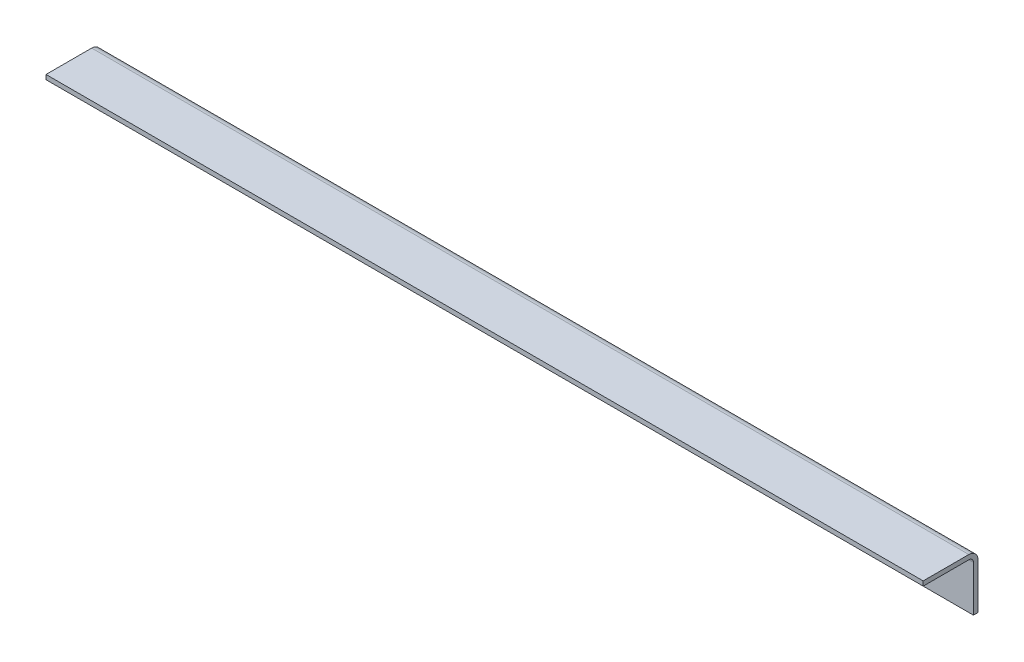
ISO-10303-21;
HEADER;
FILE_DESCRIPTION(('STEP AP214'),'2;1');
FILE_NAME('part.step','',(''),(''),'','','');
FILE_SCHEMA(('AUTOMOTIVE_DESIGN { 1 0 10303 214 1 1 1 1 }'));
ENDSEC;
DATA;
#1=APPLICATION_CONTEXT('core data for automotive mechanical design processes');
#2=APPLICATION_PROTOCOL_DEFINITION('international standard','automotive_design',2000,#1);
#3=PRODUCT_CONTEXT('',#1,'mechanical');
#4=PRODUCT('Part','Part','',(#3));
#5=PRODUCT_RELATED_PRODUCT_CATEGORY('part','',(#4));
#6=PRODUCT_DEFINITION_FORMATION('','',#4);
#7=PRODUCT_DEFINITION_CONTEXT('part definition',#1,'design');
#8=PRODUCT_DEFINITION('design','',#6,#7);
#9=PRODUCT_DEFINITION_SHAPE('','',#8);
#10=(LENGTH_UNIT() NAMED_UNIT(*) SI_UNIT(.MILLI.,.METRE.));
#11=(NAMED_UNIT(*) PLANE_ANGLE_UNIT() SI_UNIT($,.RADIAN.));
#12=(NAMED_UNIT(*) SI_UNIT($,.STERADIAN.) SOLID_ANGLE_UNIT());
#13=UNCERTAINTY_MEASURE_WITH_UNIT(LENGTH_MEASURE(1.E-05),#10,'distance_accuracy_value','');
#14=(GEOMETRIC_REPRESENTATION_CONTEXT(3) GLOBAL_UNCERTAINTY_ASSIGNED_CONTEXT((#13)) GLOBAL_UNIT_ASSIGNED_CONTEXT((#10,
#11,#12)) REPRESENTATION_CONTEXT('',''));
#15=CARTESIAN_POINT('',(0.,0.,0.));
#16=DIRECTION('',(0.,0.,1.));
#17=DIRECTION('',(1.,0.,0.));
#18=AXIS2_PLACEMENT_3D('',#15,#16,#17);
#19=CARTESIAN_POINT('',(609.6,-3.175,38.1));
#20=DIRECTION('',(0.,0.,-1.));
#21=DIRECTION('',(-1.,0.,0.));
#22=AXIS2_PLACEMENT_3D('',#19,#20,#21);
#23=PLANE('',#22);
#24=DIRECTION('',(0.,-1.,0.));
#25=VECTOR('',#24,1.);
#26=CARTESIAN_POINT('',(0.,-3.175,38.1));
#27=LINE('',#26,#25);
#28=CARTESIAN_POINT('',(0.,0.,38.1));
#29=VERTEX_POINT('',#28);
#30=CARTESIAN_POINT('',(0.,-3.175,38.1));
#31=VERTEX_POINT('',#30);
#32=EDGE_CURVE('E123',#29,#31,#27,.T.);
#33=ORIENTED_EDGE('',*,*,#32,.T.);
#34=DIRECTION('',(-1.,0.,0.));
#35=VECTOR('',#34,1.);
#36=CARTESIAN_POINT('',(609.6,-3.175,38.1));
#37=LINE('',#36,#35);
#38=CARTESIAN_POINT('',(609.6,-3.175,38.1));
#39=VERTEX_POINT('',#38);
#40=EDGE_CURVE('E104',#39,#31,#37,.T.);
#41=ORIENTED_EDGE('',*,*,#40,.F.);
#42=DIRECTION('',(0.,-1.,0.));
#43=VECTOR('',#42,1.);
#44=CARTESIAN_POINT('',(609.6,-3.175,38.1));
#45=LINE('',#44,#43);
#46=CARTESIAN_POINT('',(609.6,0.,38.1));
#47=VERTEX_POINT('',#46);
#48=EDGE_CURVE('E111',#47,#39,#45,.T.);
#49=ORIENTED_EDGE('',*,*,#48,.F.);
#50=DIRECTION('',(-1.,0.,0.));
#51=VECTOR('',#50,1.);
#52=CARTESIAN_POINT('',(609.6,0.,38.1));
#53=LINE('',#52,#51);
#54=EDGE_CURVE('E154',#47,#29,#53,.T.);
#55=ORIENTED_EDGE('',*,*,#54,.T.);
#56=EDGE_LOOP('',(#33,#41,#49,#55));
#57=FACE_BOUND('',#56,.T.);
#58=ADVANCED_FACE('F34',(#57),#23,.F.);
#59=CARTESIAN_POINT('',(609.6,-3.175,3.17499999999999));
#60=DIRECTION('',(0.,1.,0.));
#61=DIRECTION('',(0.,0.,1.));
#62=AXIS2_PLACEMENT_3D('',#59,#60,#61);
#63=PLANE('',#62);
#64=DIRECTION('',(0.,0.,-1.));
#65=VECTOR('',#64,1.);
#66=CARTESIAN_POINT('',(0.,-3.175,3.17499999999999));
#67=LINE('',#66,#65);
#68=CARTESIAN_POINT('',(0.,-3.175,6.34999999999999));
#69=VERTEX_POINT('',#68);
#70=EDGE_CURVE('E164',#31,#69,#67,.T.);
#71=ORIENTED_EDGE('',*,*,#70,.T.);
#72=DIRECTION('',(-1.,0.,0.));
#73=VECTOR('',#72,1.);
#74=CARTESIAN_POINT('',(609.6,-3.175,6.34999999999999));
#75=LINE('',#74,#73);
#76=CARTESIAN_POINT('',(609.6,-3.175,6.34999999999999));
#77=VERTEX_POINT('',#76);
#78=EDGE_CURVE('E107',#69,#77,#75,.F.);
#79=ORIENTED_EDGE('',*,*,#78,.T.);
#80=DIRECTION('',(0.,0.,-1.));
#81=VECTOR('',#80,1.);
#82=CARTESIAN_POINT('',(609.6,-3.175,3.17499999999999));
#83=LINE('',#82,#81);
#84=EDGE_CURVE('E99',#39,#77,#83,.T.);
#85=ORIENTED_EDGE('',*,*,#84,.F.);
#86=ORIENTED_EDGE('',*,*,#40,.T.);
#87=EDGE_LOOP('',(#71,#79,#85,#86));
#88=FACE_BOUND('',#87,.T.);
#89=ADVANCED_FACE('F102',(#88),#63,.F.);
#90=CARTESIAN_POINT('',(609.6,-38.1,3.17499999999999));
#91=DIRECTION('',(0.,0.,-1.));
#92=DIRECTION('',(0.,1.,0.));
#93=AXIS2_PLACEMENT_3D('',#90,#91,#92);
#94=PLANE('',#93);
#95=CARTESIAN_POINT('',(50.8,-22.225,3.17499999999999));
#96=DIRECTION('',(0.,0.,1.));
#97=DIRECTION('',(1.,0.,0.));
#98=AXIS2_PLACEMENT_3D('',#95,#96,#97);
#99=CIRCLE('',#98,3.3782);
#100=CARTESIAN_POINT('',(54.1782,-22.225,3.17499999999999));
#101=VERTEX_POINT('',#100);
#102=EDGE_CURVE('E181',#101,#101,#99,.T.);
#103=ORIENTED_EDGE('',*,*,#102,.F.);
#104=EDGE_LOOP('',(#103));
#105=FACE_BOUND('',#104,.T.);
#106=CARTESIAN_POINT('',(558.8,-22.225,3.17499999999999));
#107=DIRECTION('',(0.,0.,1.));
#108=DIRECTION('',(1.,0.,0.));
#109=AXIS2_PLACEMENT_3D('',#106,#107,#108);
#110=CIRCLE('',#109,3.37819999999999);
#111=CARTESIAN_POINT('',(562.1782,-22.225,3.17499999999999));
#112=VERTEX_POINT('',#111);
#113=EDGE_CURVE('E187',#112,#112,#110,.T.);
#114=ORIENTED_EDGE('',*,*,#113,.F.);
#115=EDGE_LOOP('',(#114));
#116=FACE_BOUND('',#115,.T.);
#117=CARTESIAN_POINT('',(304.8,-22.225,3.17499999999999));
#118=DIRECTION('',(0.,0.,1.));
#119=DIRECTION('',(1.,0.,0.));
#120=AXIS2_PLACEMENT_3D('',#117,#118,#119);
#121=CIRCLE('',#120,3.37819999999999);
#122=CARTESIAN_POINT('',(308.1782,-22.225,3.17499999999999));
#123=VERTEX_POINT('',#122);
#124=EDGE_CURVE('E175',#123,#123,#121,.T.);
#125=ORIENTED_EDGE('',*,*,#124,.F.);
#126=EDGE_LOOP('',(#125));
#127=FACE_BOUND('',#126,.T.);
#128=DIRECTION('',(0.,-1.,0.));
#129=VECTOR('',#128,1.);
#130=CARTESIAN_POINT('',(609.6,-38.1,3.17499999999999));
#131=LINE('',#130,#129);
#132=CARTESIAN_POINT('',(609.6,-6.35,3.17499999999999));
#133=VERTEX_POINT('',#132);
#134=CARTESIAN_POINT('',(609.6,-38.1,3.17499999999999));
#135=VERTEX_POINT('',#134);
#136=EDGE_CURVE('E110',#133,#135,#131,.T.);
#137=ORIENTED_EDGE('',*,*,#136,.F.);
#138=DIRECTION('',(-1.,0.,0.));
#139=VECTOR('',#138,1.);
#140=CARTESIAN_POINT('',(0.,-6.35,3.175));
#141=LINE('',#140,#139);
#142=CARTESIAN_POINT('',(0.,-6.35,3.17499999999999));
#143=VERTEX_POINT('',#142);
#144=EDGE_CURVE('E124',#133,#143,#141,.T.);
#145=ORIENTED_EDGE('',*,*,#144,.T.);
#146=DIRECTION('',(0.,-1.,0.));
#147=VECTOR('',#146,1.);
#148=CARTESIAN_POINT('',(0.,-38.1,3.17499999999999));
#149=LINE('',#148,#147);
#150=CARTESIAN_POINT('',(0.,-38.1,3.17499999999999));
#151=VERTEX_POINT('',#150);
#152=EDGE_CURVE('E163',#143,#151,#149,.T.);
#153=ORIENTED_EDGE('',*,*,#152,.T.);
#154=DIRECTION('',(-1.,0.,0.));
#155=VECTOR('',#154,1.);
#156=CARTESIAN_POINT('',(609.6,-38.1,3.17499999999999));
#157=LINE('',#156,#155);
#158=EDGE_CURVE('E125',#135,#151,#157,.T.);
#159=ORIENTED_EDGE('',*,*,#158,.F.);
#160=EDGE_LOOP('',(#137,#145,#153,#159));
#161=FACE_BOUND('',#160,.T.);
#162=ADVANCED_FACE('F203',(#105,#116,#127,#161),#94,.F.);
#163=CARTESIAN_POINT('',(609.6,-38.1,0.));
#164=DIRECTION('',(0.,1.,0.));
#165=DIRECTION('',(0.,0.,1.));
#166=AXIS2_PLACEMENT_3D('',#163,#164,#165);
#167=PLANE('',#166);
#168=DIRECTION('',(0.,0.,-1.));
#169=VECTOR('',#168,1.);
#170=CARTESIAN_POINT('',(0.,-38.1,0.));
#171=LINE('',#170,#169);
#172=CARTESIAN_POINT('',(0.,-38.1,0.));
#173=VERTEX_POINT('',#172);
#174=EDGE_CURVE('E150',#151,#173,#171,.T.);
#175=ORIENTED_EDGE('',*,*,#174,.T.);
#176=DIRECTION('',(-1.,0.,0.));
#177=VECTOR('',#176,1.);
#178=CARTESIAN_POINT('',(609.6,-38.1,0.));
#179=LINE('',#178,#177);
#180=CARTESIAN_POINT('',(609.6,-38.1,0.));
#181=VERTEX_POINT('',#180);
#182=EDGE_CURVE('E130',#181,#173,#179,.T.);
#183=ORIENTED_EDGE('',*,*,#182,.F.);
#184=DIRECTION('',(0.,0.,-1.));
#185=VECTOR('',#184,1.);
#186=CARTESIAN_POINT('',(609.6,-38.1,0.));
#187=LINE('',#186,#185);
#188=EDGE_CURVE('E172',#135,#181,#187,.T.);
#189=ORIENTED_EDGE('',*,*,#188,.F.);
#190=ORIENTED_EDGE('',*,*,#158,.T.);
#191=EDGE_LOOP('',(#175,#183,#189,#190));
#192=FACE_BOUND('',#191,.T.);
#193=ADVANCED_FACE('F206',(#192),#167,.F.);
#194=CARTESIAN_POINT('',(609.6,0.,0.));
#195=DIRECTION('',(0.,0.,1.));
#196=DIRECTION('',(0.,-1.,0.));
#197=AXIS2_PLACEMENT_3D('',#194,#195,#196);
#198=PLANE('',#197);
#199=CARTESIAN_POINT('',(50.8,-22.225,0.));
#200=DIRECTION('',(0.,0.,1.));
#201=DIRECTION('',(1.,0.,0.));
#202=AXIS2_PLACEMENT_3D('',#199,#200,#201);
#203=CIRCLE('',#202,3.3782);
#204=CARTESIAN_POINT('',(54.1782,-22.225,0.));
#205=VERTEX_POINT('',#204);
#206=EDGE_CURVE('E184',#205,#205,#203,.T.);
#207=ORIENTED_EDGE('',*,*,#206,.T.);
#208=EDGE_LOOP('',(#207));
#209=FACE_BOUND('',#208,.T.);
#210=CARTESIAN_POINT('',(558.8,-22.225,0.));
#211=DIRECTION('',(0.,0.,1.));
#212=DIRECTION('',(1.,0.,0.));
#213=AXIS2_PLACEMENT_3D('',#210,#211,#212);
#214=CIRCLE('',#213,3.37819999999999);
#215=CARTESIAN_POINT('',(562.1782,-22.225,0.));
#216=VERTEX_POINT('',#215);
#217=EDGE_CURVE('E178',#216,#216,#214,.T.);
#218=ORIENTED_EDGE('',*,*,#217,.T.);
#219=EDGE_LOOP('',(#218));
#220=FACE_BOUND('',#219,.T.);
#221=CARTESIAN_POINT('',(304.8,-22.225,0.));
#222=DIRECTION('',(0.,0.,1.));
#223=DIRECTION('',(1.,0.,0.));
#224=AXIS2_PLACEMENT_3D('',#221,#222,#223);
#225=CIRCLE('',#224,3.37819999999999);
#226=CARTESIAN_POINT('',(308.1782,-22.225,0.));
#227=VERTEX_POINT('',#226);
#228=EDGE_CURVE('E169',#227,#227,#225,.T.);
#229=ORIENTED_EDGE('',*,*,#228,.T.);
#230=EDGE_LOOP('',(#229));
#231=FACE_BOUND('',#230,.T.);
#232=DIRECTION('',(0.,1.,0.));
#233=VECTOR('',#232,1.);
#234=CARTESIAN_POINT('',(0.,0.,0.));
#235=LINE('',#234,#233);
#236=CARTESIAN_POINT('',(0.,-6.35,0.));
#237=VERTEX_POINT('',#236);
#238=EDGE_CURVE('E148',#173,#237,#235,.T.);
#239=ORIENTED_EDGE('',*,*,#238,.T.);
#240=DIRECTION('',(-1.,0.,0.));
#241=VECTOR('',#240,1.);
#242=CARTESIAN_POINT('',(609.6,-6.35,0.));
#243=LINE('',#242,#241);
#244=CARTESIAN_POINT('',(609.6,-6.35,0.));
#245=VERTEX_POINT('',#244);
#246=EDGE_CURVE('E42',#237,#245,#243,.F.);
#247=ORIENTED_EDGE('',*,*,#246,.T.);
#248=DIRECTION('',(0.,1.,0.));
#249=VECTOR('',#248,1.);
#250=CARTESIAN_POINT('',(609.6,0.,0.));
#251=LINE('',#250,#249);
#252=EDGE_CURVE('E158',#181,#245,#251,.T.);
#253=ORIENTED_EDGE('',*,*,#252,.F.);
#254=ORIENTED_EDGE('',*,*,#182,.T.);
#255=EDGE_LOOP('',(#239,#247,#253,#254));
#256=FACE_BOUND('',#255,.T.);
#257=ADVANCED_FACE('F157',(#209,#220,#231,#256),#198,.F.);
#258=CARTESIAN_POINT('',(609.6,0.,38.1));
#259=DIRECTION('',(0.,-1.,0.));
#260=DIRECTION('',(0.,0.,-1.));
#261=AXIS2_PLACEMENT_3D('',#258,#259,#260);
#262=PLANE('',#261);
#263=DIRECTION('',(0.,0.,1.));
#264=VECTOR('',#263,1.);
#265=CARTESIAN_POINT('',(609.6,0.,38.1));
#266=LINE('',#265,#264);
#267=CARTESIAN_POINT('',(609.6,0.,6.35000000000002));
#268=VERTEX_POINT('',#267);
#269=EDGE_CURVE('E116',#268,#47,#266,.T.);
#270=ORIENTED_EDGE('',*,*,#269,.F.);
#271=DIRECTION('',(-1.,0.,0.));
#272=VECTOR('',#271,1.);
#273=CARTESIAN_POINT('',(609.6,0.,6.35));
#274=LINE('',#273,#272);
#275=CARTESIAN_POINT('',(0.,0.,6.35000000000002));
#276=VERTEX_POINT('',#275);
#277=EDGE_CURVE('E139',#268,#276,#274,.T.);
#278=ORIENTED_EDGE('',*,*,#277,.T.);
#279=DIRECTION('',(0.,0.,1.));
#280=VECTOR('',#279,1.);
#281=CARTESIAN_POINT('',(0.,0.,38.1));
#282=LINE('',#281,#280);
#283=EDGE_CURVE('E120',#276,#29,#282,.T.);
#284=ORIENTED_EDGE('',*,*,#283,.T.);
#285=ORIENTED_EDGE('',*,*,#54,.F.);
#286=EDGE_LOOP('',(#270,#278,#284,#285));
#287=FACE_BOUND('',#286,.T.);
#288=ADVANCED_FACE('F144',(#287),#262,.F.);
#289=CARTESIAN_POINT('',(609.6,0.,0.));
#290=DIRECTION('',(-1.,0.,0.));
#291=DIRECTION('',(0.,0.,1.));
#292=AXIS2_PLACEMENT_3D('',#289,#290,#291);
#293=PLANE('',#292);
#294=ORIENTED_EDGE('',*,*,#252,.T.);
#295=CARTESIAN_POINT('',(609.6,-6.35,6.35));
#296=DIRECTION('',(-1.,0.,0.));
#297=DIRECTION('',(0.,0.,1.));
#298=AXIS2_PLACEMENT_3D('',#295,#296,#297);
#299=CIRCLE('',#298,6.35);
#300=EDGE_CURVE('E11',#245,#268,#299,.F.);
#301=ORIENTED_EDGE('',*,*,#300,.T.);
#302=ORIENTED_EDGE('',*,*,#269,.T.);
#303=ORIENTED_EDGE('',*,*,#48,.T.);
#304=ORIENTED_EDGE('',*,*,#84,.T.);
#305=CARTESIAN_POINT('',(609.6,-6.35,6.34999999999999));
#306=DIRECTION('',(-1.,0.,0.));
#307=DIRECTION('',(0.,0.,1.));
#308=AXIS2_PLACEMENT_3D('',#305,#306,#307);
#309=CIRCLE('',#308,3.175);
#310=EDGE_CURVE('E137',#77,#133,#309,.T.);
#311=ORIENTED_EDGE('',*,*,#310,.T.);
#312=ORIENTED_EDGE('',*,*,#136,.T.);
#313=ORIENTED_EDGE('',*,*,#188,.T.);
#314=EDGE_LOOP('',(#294,#301,#302,#303,#304,#311,#312,#313));
#315=FACE_BOUND('',#314,.T.);
#316=ADVANCED_FACE('F114',(#315),#293,.F.);
#317=CARTESIAN_POINT('',(0.,0.,0.));
#318=DIRECTION('',(-1.,0.,0.));
#319=DIRECTION('',(0.,0.,1.));
#320=AXIS2_PLACEMENT_3D('',#317,#318,#319);
#321=PLANE('',#320);
#322=ORIENTED_EDGE('',*,*,#283,.F.);
#323=CARTESIAN_POINT('',(0.,-6.35,6.35));
#324=DIRECTION('',(-1.,0.,0.));
#325=DIRECTION('',(0.,0.,1.));
#326=AXIS2_PLACEMENT_3D('',#323,#324,#325);
#327=CIRCLE('',#326,6.35);
#328=EDGE_CURVE('E56',#276,#237,#327,.T.);
#329=ORIENTED_EDGE('',*,*,#328,.T.);
#330=ORIENTED_EDGE('',*,*,#238,.F.);
#331=ORIENTED_EDGE('',*,*,#174,.F.);
#332=ORIENTED_EDGE('',*,*,#152,.F.);
#333=CARTESIAN_POINT('',(0.,-6.35,6.34999999999999));
#334=DIRECTION('',(-1.,0.,0.));
#335=DIRECTION('',(0.,0.,1.));
#336=AXIS2_PLACEMENT_3D('',#333,#334,#335);
#337=CIRCLE('',#336,3.175);
#338=EDGE_CURVE('E135',#143,#69,#337,.F.);
#339=ORIENTED_EDGE('',*,*,#338,.T.);
#340=ORIENTED_EDGE('',*,*,#70,.F.);
#341=ORIENTED_EDGE('',*,*,#32,.F.);
#342=EDGE_LOOP('',(#322,#329,#330,#331,#332,#339,#340,#341));
#343=FACE_BOUND('',#342,.T.);
#344=ADVANCED_FACE('F147',(#343),#321,.T.);
#345=CARTESIAN_POINT('',(609.6,-6.35,6.34999999999999));
#346=DIRECTION('',(1.,0.,0.));
#347=DIRECTION('',(0.,0.,-1.));
#348=AXIS2_PLACEMENT_3D('',#345,#346,#347);
#349=CYLINDRICAL_SURFACE('',#348,3.175);
#350=ORIENTED_EDGE('',*,*,#310,.F.);
#351=ORIENTED_EDGE('',*,*,#78,.F.);
#352=ORIENTED_EDGE('',*,*,#338,.F.);
#353=ORIENTED_EDGE('',*,*,#144,.F.);
#354=EDGE_LOOP('',(#350,#351,#352,#353));
#355=FACE_BOUND('',#354,.T.);
#356=ADVANCED_FACE('F215',(#355),#349,.F.);
#357=CARTESIAN_POINT('',(609.6,-6.35,6.35));
#358=DIRECTION('',(-1.,0.,0.));
#359=DIRECTION('',(0.,0.,1.));
#360=AXIS2_PLACEMENT_3D('',#357,#358,#359);
#361=CYLINDRICAL_SURFACE('',#360,6.35);
#362=ORIENTED_EDGE('',*,*,#300,.F.);
#363=ORIENTED_EDGE('',*,*,#246,.F.);
#364=ORIENTED_EDGE('',*,*,#328,.F.);
#365=ORIENTED_EDGE('',*,*,#277,.F.);
#366=EDGE_LOOP('',(#362,#363,#364,#365));
#367=FACE_BOUND('',#366,.T.);
#368=ADVANCED_FACE('F36',(#367),#361,.T.);
#369=CARTESIAN_POINT('',(304.8,-22.225,0.));
#370=DIRECTION('',(0.,0.,1.));
#371=DIRECTION('',(1.,0.,0.));
#372=AXIS2_PLACEMENT_3D('',#369,#370,#371);
#373=CYLINDRICAL_SURFACE('',#372,3.37819999999999);
#374=ORIENTED_EDGE('',*,*,#228,.F.);
#375=EDGE_LOOP('',(#374));
#376=FACE_BOUND('',#375,.T.);
#377=ORIENTED_EDGE('',*,*,#124,.T.);
#378=EDGE_LOOP('',(#377));
#379=FACE_BOUND('',#378,.T.);
#380=ADVANCED_FACE('F199',(#376,#379),#373,.F.);
#381=CARTESIAN_POINT('',(558.8,-22.225,0.));
#382=DIRECTION('',(0.,0.,1.));
#383=DIRECTION('',(1.,0.,0.));
#384=AXIS2_PLACEMENT_3D('',#381,#382,#383);
#385=CYLINDRICAL_SURFACE('',#384,3.37819999999999);
#386=ORIENTED_EDGE('',*,*,#217,.F.);
#387=EDGE_LOOP('',(#386));
#388=FACE_BOUND('',#387,.T.);
#389=ORIENTED_EDGE('',*,*,#113,.T.);
#390=EDGE_LOOP('',(#389));
#391=FACE_BOUND('',#390,.T.);
#392=ADVANCED_FACE('F195',(#388,#391),#385,.F.);
#393=CARTESIAN_POINT('',(50.8,-22.225,0.));
#394=DIRECTION('',(0.,0.,1.));
#395=DIRECTION('',(1.,0.,0.));
#396=AXIS2_PLACEMENT_3D('',#393,#394,#395);
#397=CYLINDRICAL_SURFACE('',#396,3.3782);
#398=ORIENTED_EDGE('',*,*,#206,.F.);
#399=EDGE_LOOP('',(#398));
#400=FACE_BOUND('',#399,.T.);
#401=ORIENTED_EDGE('',*,*,#102,.T.);
#402=EDGE_LOOP('',(#401));
#403=FACE_BOUND('',#402,.T.);
#404=ADVANCED_FACE('F198',(#400,#403),#397,.F.);
#405=CLOSED_SHELL('',(#58,#89,#162,#193,#257,#288,#316,#344,#356,#368,#380,#392,#404));
#406=MANIFOLD_SOLID_BREP('B2',#405);
#407=ADVANCED_BREP_SHAPE_REPRESENTATION('',(#18,#406),#14);
#408=SHAPE_DEFINITION_REPRESENTATION(#9,#407);
ENDSEC;
END-ISO-10303-21;
